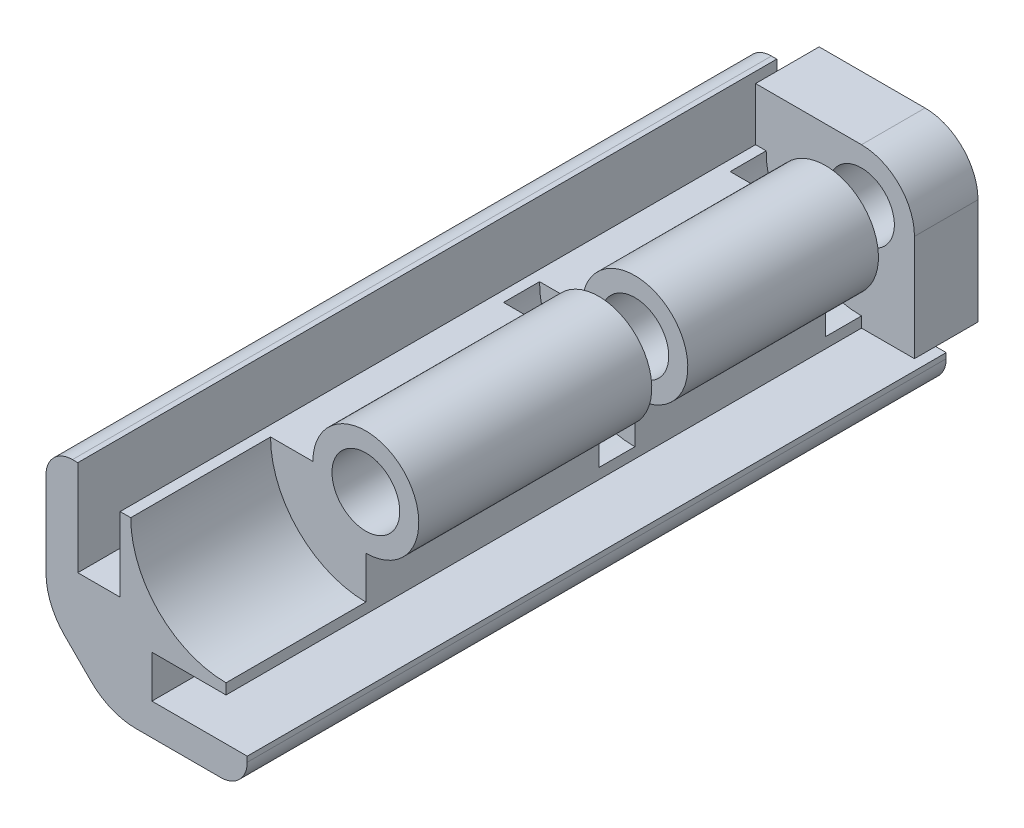
ISO-10303-21;
HEADER;
FILE_DESCRIPTION(('STEP AP214'),'2;1');
FILE_NAME('part.step','',(''),(''),'','','');
FILE_SCHEMA(('AUTOMOTIVE_DESIGN { 1 0 10303 214 1 1 1 1 }'));
ENDSEC;
DATA;
#1=APPLICATION_CONTEXT('core data for automotive mechanical design processes');
#2=APPLICATION_PROTOCOL_DEFINITION('international standard','automotive_design',2000,#1);
#3=PRODUCT_CONTEXT('',#1,'mechanical');
#4=PRODUCT('Part','Part','',(#3));
#5=PRODUCT_RELATED_PRODUCT_CATEGORY('part','',(#4));
#6=PRODUCT_DEFINITION_FORMATION('','',#4);
#7=PRODUCT_DEFINITION_CONTEXT('part definition',#1,'design');
#8=PRODUCT_DEFINITION('design','',#6,#7);
#9=PRODUCT_DEFINITION_SHAPE('','',#8);
#10=(LENGTH_UNIT() NAMED_UNIT(*) SI_UNIT(.MILLI.,.METRE.));
#11=(NAMED_UNIT(*) PLANE_ANGLE_UNIT() SI_UNIT($,.RADIAN.));
#12=(NAMED_UNIT(*) SI_UNIT($,.STERADIAN.) SOLID_ANGLE_UNIT());
#13=UNCERTAINTY_MEASURE_WITH_UNIT(LENGTH_MEASURE(1.E-05),#10,'distance_accuracy_value','');
#14=(GEOMETRIC_REPRESENTATION_CONTEXT(3) GLOBAL_UNCERTAINTY_ASSIGNED_CONTEXT((#13)) GLOBAL_UNIT_ASSIGNED_CONTEXT((#10,
#11,#12)) REPRESENTATION_CONTEXT('',''));
#15=CARTESIAN_POINT('',(0.,0.,0.));
#16=DIRECTION('',(0.,0.,1.));
#17=DIRECTION('',(1.,0.,0.));
#18=AXIS2_PLACEMENT_3D('',#15,#16,#17);
#19=CARTESIAN_POINT('',(8.5,8.5,3.));
#20=DIRECTION('',(0.,0.,1.));
#21=DIRECTION('',(1.,0.,0.));
#22=AXIS2_PLACEMENT_3D('',#19,#20,#21);
#23=CYLINDRICAL_SURFACE('',#22,4.5);
#24=CARTESIAN_POINT('',(8.5,8.5,4.7));
#25=DIRECTION('',(0.,0.,1.));
#26=DIRECTION('',(1.,0.,0.));
#27=AXIS2_PLACEMENT_3D('',#24,#25,#26);
#28=CIRCLE('',#27,4.5);
#29=CARTESIAN_POINT('',(8.5,4.,4.7));
#30=VERTEX_POINT('',#29);
#31=CARTESIAN_POINT('',(4.,8.5,4.7));
#32=VERTEX_POINT('',#31);
#33=EDGE_CURVE('E249',#30,#32,#28,.F.);
#34=ORIENTED_EDGE('',*,*,#33,.F.);
#35=DIRECTION('',(0.,0.,1.));
#36=VECTOR('',#35,1.);
#37=CARTESIAN_POINT('',(8.5,4.,3.));
#38=LINE('',#37,#36);
#39=CARTESIAN_POINT('',(8.5,4.,3.));
#40=VERTEX_POINT('',#39);
#41=EDGE_CURVE('E341',#40,#30,#38,.T.);
#42=ORIENTED_EDGE('',*,*,#41,.F.);
#43=CARTESIAN_POINT('',(8.5,8.5,3.));
#44=DIRECTION('',(0.,0.,1.));
#45=DIRECTION('',(-1.,0.,0.));
#46=AXIS2_PLACEMENT_3D('',#43,#44,#45);
#47=CIRCLE('',#46,4.5);
#48=CARTESIAN_POINT('',(4.,8.5,3.));
#49=VERTEX_POINT('',#48);
#50=EDGE_CURVE('E306',#49,#40,#47,.T.);
#51=ORIENTED_EDGE('',*,*,#50,.F.);
#52=DIRECTION('',(0.,0.,1.));
#53=VECTOR('',#52,1.);
#54=CARTESIAN_POINT('',(4.,8.5,3.));
#55=LINE('',#54,#53);
#56=EDGE_CURVE('E332',#49,#32,#55,.T.);
#57=ORIENTED_EDGE('',*,*,#56,.T.);
#58=EDGE_LOOP('',(#34,#42,#51,#57));
#59=FACE_BOUND('',#58,.T.);
#60=ADVANCED_FACE('F37',(#59),#23,.F.);
#61=CARTESIAN_POINT('',(8.5,4.,13.7));
#62=VERTEX_POINT('',#61);
#63=CARTESIAN_POINT('',(8.50000000002638,4.,15.4));
#64=VERTEX_POINT('',#63);
#65=EDGE_CURVE('E344',#62,#64,#38,.T.);
#66=ORIENTED_EDGE('',*,*,#65,.F.);
#67=CARTESIAN_POINT('',(8.5,8.5,13.7));
#68=DIRECTION('',(0.,0.,1.));
#69=DIRECTION('',(1.,0.,0.));
#70=AXIS2_PLACEMENT_3D('',#67,#68,#69);
#71=CIRCLE('',#70,4.5);
#72=CARTESIAN_POINT('',(4.,8.5,13.7));
#73=VERTEX_POINT('',#72);
#74=EDGE_CURVE('E273',#62,#73,#71,.F.);
#75=ORIENTED_EDGE('',*,*,#74,.T.);
#76=CARTESIAN_POINT('',(4.0000000000191,8.50000000002638,15.4));
#77=VERTEX_POINT('',#76);
#78=EDGE_CURVE('E255',#73,#77,#55,.T.);
#79=ORIENTED_EDGE('',*,*,#78,.T.);
#80=CARTESIAN_POINT('',(8.5,8.5,15.4));
#81=DIRECTION('',(0.,0.,1.));
#82=DIRECTION('',(1.,0.,0.));
#83=AXIS2_PLACEMENT_3D('',#80,#81,#82);
#84=CIRCLE('',#83,4.5);
#85=EDGE_CURVE('E294',#77,#64,#84,.T.);
#86=ORIENTED_EDGE('',*,*,#85,.T.);
#87=EDGE_LOOP('',(#66,#75,#79,#86));
#88=FACE_BOUND('',#87,.T.);
#89=ADVANCED_FACE('F594',(#88),#23,.F.);
#90=CARTESIAN_POINT('',(4.24264068711928,3.,33.));
#91=DIRECTION('',(0.,0.,1.));
#92=DIRECTION('',(1.,0.,0.));
#93=AXIS2_PLACEMENT_3D('',#90,#91,#92);
#94=PLANE('',#93);
#95=DIRECTION('',(1.,0.,0.));
#96=VECTOR('',#95,1.);
#97=CARTESIAN_POINT('',(4.,8.5,33.));
#98=LINE('',#97,#96);
#99=CARTESIAN_POINT('',(3.50000000000006,8.5,33.));
#100=VERTEX_POINT('',#99);
#101=CARTESIAN_POINT('',(4.,8.5,33.));
#102=VERTEX_POINT('',#101);
#103=EDGE_CURVE('E310',#100,#102,#98,.T.);
#104=ORIENTED_EDGE('',*,*,#103,.F.);
#105=DIRECTION('',(0.,-1.,0.));
#106=VECTOR('',#105,1.);
#107=CARTESIAN_POINT('',(3.50000000000006,5.,33.));
#108=LINE('',#107,#106);
#109=CARTESIAN_POINT('',(3.50000000000006,5.,33.));
#110=VERTEX_POINT('',#109);
#111=EDGE_CURVE('E366',#100,#110,#108,.T.);
#112=ORIENTED_EDGE('',*,*,#111,.T.);
#113=DIRECTION('',(-1.,0.,0.));
#114=VECTOR('',#113,1.);
#115=CARTESIAN_POINT('',(3.50000000000006,5.,33.));
#116=LINE('',#115,#114);
#117=CARTESIAN_POINT('',(1.50000000000006,5.,33.));
#118=VERTEX_POINT('',#117);
#119=EDGE_CURVE('E368',#110,#118,#116,.T.);
#120=ORIENTED_EDGE('',*,*,#119,.T.);
#121=DIRECTION('',(0.,1.,0.));
#122=VECTOR('',#121,1.);
#123=CARTESIAN_POINT('',(1.50000000000006,5.,33.));
#124=LINE('',#123,#122);
#125=CARTESIAN_POINT('',(1.50000000000006,9.5,33.));
#126=VERTEX_POINT('',#125);
#127=EDGE_CURVE('E370',#118,#126,#124,.T.);
#128=ORIENTED_EDGE('',*,*,#127,.T.);
#129=DIRECTION('',(-1.,0.,0.));
#130=VECTOR('',#129,1.);
#131=CARTESIAN_POINT('',(1.50000000000006,9.5,33.));
#132=LINE('',#131,#130);
#133=CARTESIAN_POINT('',(1.25000000000001,9.5,33.));
#134=VERTEX_POINT('',#133);
#135=EDGE_CURVE('E372',#126,#134,#132,.T.);
#136=ORIENTED_EDGE('',*,*,#135,.T.);
#137=CARTESIAN_POINT('',(1.25,8.25,33.));
#138=DIRECTION('',(0.,0.,1.));
#139=DIRECTION('',(1.,0.,0.));
#140=AXIS2_PLACEMENT_3D('',#137,#138,#139);
#141=CIRCLE('',#140,1.25);
#142=CARTESIAN_POINT('',(0.,8.24999999999999,33.));
#143=VERTEX_POINT('',#142);
#144=EDGE_CURVE('E374',#134,#143,#141,.T.);
#145=ORIENTED_EDGE('',*,*,#144,.T.);
#146=DIRECTION('',(0.,-1.,0.));
#147=VECTOR('',#146,1.);
#148=CARTESIAN_POINT('',(0.,8.24999999999999,33.));
#149=LINE('',#148,#147);
#150=CARTESIAN_POINT('',(0.,4.24264068711929,33.));
#151=VERTEX_POINT('',#150);
#152=EDGE_CURVE('E376',#143,#151,#149,.T.);
#153=ORIENTED_EDGE('',*,*,#152,.T.);
#154=CARTESIAN_POINT('',(3.,4.24264068711929,33.));
#155=DIRECTION('',(0.,0.,1.));
#156=DIRECTION('',(1.,0.,0.));
#157=AXIS2_PLACEMENT_3D('',#154,#155,#156);
#158=CIRCLE('',#157,3.);
#159=CARTESIAN_POINT('',(0.878679656440357,2.12132034355964,33.));
#160=VERTEX_POINT('',#159);
#161=EDGE_CURVE('E378',#151,#160,#158,.T.);
#162=ORIENTED_EDGE('',*,*,#161,.T.);
#163=DIRECTION('',(0.707106781186548,-0.707106781186547,0.));
#164=VECTOR('',#163,1.);
#165=CARTESIAN_POINT('',(2.12132034355964,0.878679656440358,33.));
#166=LINE('',#165,#164);
#167=CARTESIAN_POINT('',(2.12132034355964,0.878679656440358,33.));
#168=VERTEX_POINT('',#167);
#169=EDGE_CURVE('E380',#160,#168,#166,.T.);
#170=ORIENTED_EDGE('',*,*,#169,.T.);
#171=CARTESIAN_POINT('',(4.24264068711928,3.,33.));
#172=DIRECTION('',(0.,0.,1.));
#173=DIRECTION('',(1.,0.,0.));
#174=AXIS2_PLACEMENT_3D('',#171,#172,#173);
#175=CIRCLE('',#174,3.);
#176=CARTESIAN_POINT('',(4.24264068711928,0.,33.));
#177=VERTEX_POINT('',#176);
#178=EDGE_CURVE('E349',#168,#177,#175,.T.);
#179=ORIENTED_EDGE('',*,*,#178,.T.);
#180=DIRECTION('',(1.,0.,0.));
#181=VECTOR('',#180,1.);
#182=CARTESIAN_POINT('',(8.25,0.,33.));
#183=LINE('',#182,#181);
#184=CARTESIAN_POINT('',(8.25,0.,33.));
#185=VERTEX_POINT('',#184);
#186=EDGE_CURVE('E352',#177,#185,#183,.T.);
#187=ORIENTED_EDGE('',*,*,#186,.T.);
#188=CARTESIAN_POINT('',(8.25,1.25,33.));
#189=DIRECTION('',(0.,0.,1.));
#190=DIRECTION('',(-1.,0.,0.));
#191=AXIS2_PLACEMENT_3D('',#188,#189,#190);
#192=CIRCLE('',#191,1.25);
#193=CARTESIAN_POINT('',(9.5,1.25,33.));
#194=VERTEX_POINT('',#193);
#195=EDGE_CURVE('E355',#185,#194,#192,.T.);
#196=ORIENTED_EDGE('',*,*,#195,.T.);
#197=DIRECTION('',(0.,1.,0.));
#198=VECTOR('',#197,1.);
#199=CARTESIAN_POINT('',(9.5,1.5,33.));
#200=LINE('',#199,#198);
#201=CARTESIAN_POINT('',(9.5,1.5,33.));
#202=VERTEX_POINT('',#201);
#203=EDGE_CURVE('E357',#194,#202,#200,.T.);
#204=ORIENTED_EDGE('',*,*,#203,.T.);
#205=DIRECTION('',(-1.,0.,0.));
#206=VECTOR('',#205,1.);
#207=CARTESIAN_POINT('',(5.,1.5,33.));
#208=LINE('',#207,#206);
#209=CARTESIAN_POINT('',(5.,1.5,33.));
#210=VERTEX_POINT('',#209);
#211=EDGE_CURVE('E359',#202,#210,#208,.T.);
#212=ORIENTED_EDGE('',*,*,#211,.T.);
#213=DIRECTION('',(0.,1.,0.));
#214=VECTOR('',#213,1.);
#215=CARTESIAN_POINT('',(5.,3.5,33.));
#216=LINE('',#215,#214);
#217=CARTESIAN_POINT('',(5.,3.5,33.));
#218=VERTEX_POINT('',#217);
#219=EDGE_CURVE('E361',#210,#218,#216,.T.);
#220=ORIENTED_EDGE('',*,*,#219,.T.);
#221=DIRECTION('',(1.,0.,0.));
#222=VECTOR('',#221,1.);
#223=CARTESIAN_POINT('',(5.,3.5,33.));
#224=LINE('',#223,#222);
#225=CARTESIAN_POINT('',(8.5,3.5,33.));
#226=VERTEX_POINT('',#225);
#227=EDGE_CURVE('E363',#218,#226,#224,.T.);
#228=ORIENTED_EDGE('',*,*,#227,.T.);
#229=DIRECTION('',(0.,-1.,0.));
#230=VECTOR('',#229,1.);
#231=CARTESIAN_POINT('',(8.5,4.,33.));
#232=LINE('',#231,#230);
#233=CARTESIAN_POINT('',(8.5,4.,33.));
#234=VERTEX_POINT('',#233);
#235=EDGE_CURVE('E329',#234,#226,#232,.T.);
#236=ORIENTED_EDGE('',*,*,#235,.F.);
#237=CARTESIAN_POINT('',(8.5,8.5,33.));
#238=DIRECTION('',(0.,0.,1.));
#239=DIRECTION('',(-1.,0.,0.));
#240=AXIS2_PLACEMENT_3D('',#237,#238,#239);
#241=CIRCLE('',#240,4.5);
#242=EDGE_CURVE('E304',#102,#234,#241,.T.);
#243=ORIENTED_EDGE('',*,*,#242,.F.);
#244=EDGE_LOOP('',(#104,#112,#120,#128,#136,#145,#153,#162,#170,#179,#187,#196,#204,#212,#220,
#228,#236,#243));
#245=FACE_BOUND('',#244,.T.);
#246=ADVANCED_FACE('F491',(#245),#94,.T.);
#247=CARTESIAN_POINT('',(4.24264068711928,3.,0.));
#248=DIRECTION('',(0.,0.,1.));
#249=DIRECTION('',(1.,0.,0.));
#250=AXIS2_PLACEMENT_3D('',#247,#248,#249);
#251=PLANE('',#250);
#252=CARTESIAN_POINT('',(4.24264068711928,3.,0.));
#253=DIRECTION('',(0.,0.,1.));
#254=DIRECTION('',(1.,0.,0.));
#255=AXIS2_PLACEMENT_3D('',#252,#253,#254);
#256=CIRCLE('',#255,3.);
#257=CARTESIAN_POINT('',(2.12132034355964,0.878679656440358,0.));
#258=VERTEX_POINT('',#257);
#259=CARTESIAN_POINT('',(4.24264068711928,0.,0.));
#260=VERTEX_POINT('',#259);
#261=EDGE_CURVE('E348',#258,#260,#256,.T.);
#262=ORIENTED_EDGE('',*,*,#261,.F.);
#263=DIRECTION('',(0.707106781186548,-0.707106781186547,0.));
#264=VECTOR('',#263,1.);
#265=CARTESIAN_POINT('',(2.12132034355964,0.878679656440358,0.));
#266=LINE('',#265,#264);
#267=CARTESIAN_POINT('',(0.878679656440357,2.12132034355964,0.));
#268=VERTEX_POINT('',#267);
#269=EDGE_CURVE('E353',#268,#258,#266,.T.);
#270=ORIENTED_EDGE('',*,*,#269,.F.);
#271=CARTESIAN_POINT('',(3.,4.24264068711929,0.));
#272=DIRECTION('',(0.,0.,1.));
#273=DIRECTION('',(1.,0.,0.));
#274=AXIS2_PLACEMENT_3D('',#271,#272,#273);
#275=CIRCLE('',#274,3.);
#276=CARTESIAN_POINT('',(0.,4.24264068711929,0.));
#277=VERTEX_POINT('',#276);
#278=EDGE_CURVE('E419',#277,#268,#275,.T.);
#279=ORIENTED_EDGE('',*,*,#278,.F.);
#280=DIRECTION('',(0.,-1.,0.));
#281=VECTOR('',#280,1.);
#282=CARTESIAN_POINT('',(0.,8.24999999999999,0.));
#283=LINE('',#282,#281);
#284=CARTESIAN_POINT('',(0.,8.24999999999999,0.));
#285=VERTEX_POINT('',#284);
#286=EDGE_CURVE('E417',#285,#277,#283,.T.);
#287=ORIENTED_EDGE('',*,*,#286,.F.);
#288=CARTESIAN_POINT('',(1.25,8.25,0.));
#289=DIRECTION('',(0.,0.,1.));
#290=DIRECTION('',(1.,0.,0.));
#291=AXIS2_PLACEMENT_3D('',#288,#289,#290);
#292=CIRCLE('',#291,1.25);
#293=CARTESIAN_POINT('',(1.25000000000001,9.5,0.));
#294=VERTEX_POINT('',#293);
#295=EDGE_CURVE('E415',#294,#285,#292,.T.);
#296=ORIENTED_EDGE('',*,*,#295,.F.);
#297=DIRECTION('',(-1.,0.,0.));
#298=VECTOR('',#297,1.);
#299=CARTESIAN_POINT('',(1.50000000000006,9.5,0.));
#300=LINE('',#299,#298);
#301=CARTESIAN_POINT('',(1.50000000000006,9.5,0.));
#302=VERTEX_POINT('',#301);
#303=EDGE_CURVE('E413',#302,#294,#300,.T.);
#304=ORIENTED_EDGE('',*,*,#303,.F.);
#305=DIRECTION('',(0.,1.,0.));
#306=VECTOR('',#305,1.);
#307=CARTESIAN_POINT('',(1.50000000000006,5.,0.));
#308=LINE('',#307,#306);
#309=CARTESIAN_POINT('',(1.50000000000006,5.,0.));
#310=VERTEX_POINT('',#309);
#311=EDGE_CURVE('E411',#310,#302,#308,.T.);
#312=ORIENTED_EDGE('',*,*,#311,.F.);
#313=DIRECTION('',(-1.,0.,0.));
#314=VECTOR('',#313,1.);
#315=CARTESIAN_POINT('',(3.50000000000006,5.,0.));
#316=LINE('',#315,#314);
#317=CARTESIAN_POINT('',(3.50000000000006,5.,0.));
#318=VERTEX_POINT('',#317);
#319=EDGE_CURVE('E409',#318,#310,#316,.T.);
#320=ORIENTED_EDGE('',*,*,#319,.F.);
#321=DIRECTION('',(0.,-1.,0.));
#322=VECTOR('',#321,1.);
#323=CARTESIAN_POINT('',(3.50000000000006,5.,0.));
#324=LINE('',#323,#322);
#325=CARTESIAN_POINT('',(3.50000000000006,11.,0.));
#326=VERTEX_POINT('',#325);
#327=EDGE_CURVE('E407',#326,#318,#324,.T.);
#328=ORIENTED_EDGE('',*,*,#327,.F.);
#329=DIRECTION('',(-1.,0.,0.));
#330=VECTOR('',#329,1.);
#331=CARTESIAN_POINT('',(8.50000000000006,11.,0.));
#332=LINE('',#331,#330);
#333=CARTESIAN_POINT('',(8.50000000000006,11.,0.));
#334=VERTEX_POINT('',#333);
#335=EDGE_CURVE('E404',#334,#326,#332,.T.);
#336=ORIENTED_EDGE('',*,*,#335,.F.);
#337=CARTESIAN_POINT('',(8.5,8.5,0.));
#338=DIRECTION('',(0.,0.,1.));
#339=DIRECTION('',(-1.,0.,0.));
#340=AXIS2_PLACEMENT_3D('',#337,#338,#339);
#341=CIRCLE('',#340,2.5);
#342=CARTESIAN_POINT('',(11.,8.5,0.));
#343=VERTEX_POINT('',#342);
#344=EDGE_CURVE('E401',#343,#334,#341,.T.);
#345=ORIENTED_EDGE('',*,*,#344,.F.);
#346=DIRECTION('',(0.,1.,0.));
#347=VECTOR('',#346,1.);
#348=CARTESIAN_POINT('',(11.,3.5,0.));
#349=LINE('',#348,#347);
#350=CARTESIAN_POINT('',(11.,3.5,0.));
#351=VERTEX_POINT('',#350);
#352=EDGE_CURVE('E398',#351,#343,#349,.T.);
#353=ORIENTED_EDGE('',*,*,#352,.F.);
#354=DIRECTION('',(1.,0.,0.));
#355=VECTOR('',#354,1.);
#356=CARTESIAN_POINT('',(5.,3.5,0.));
#357=LINE('',#356,#355);
#358=CARTESIAN_POINT('',(5.,3.5,0.));
#359=VERTEX_POINT('',#358);
#360=EDGE_CURVE('E395',#359,#351,#357,.T.);
#361=ORIENTED_EDGE('',*,*,#360,.F.);
#362=DIRECTION('',(0.,1.,0.));
#363=VECTOR('',#362,1.);
#364=CARTESIAN_POINT('',(5.,3.5,0.));
#365=LINE('',#364,#363);
#366=CARTESIAN_POINT('',(5.,1.5,0.));
#367=VERTEX_POINT('',#366);
#368=EDGE_CURVE('E393',#367,#359,#365,.T.);
#369=ORIENTED_EDGE('',*,*,#368,.F.);
#370=DIRECTION('',(-1.,0.,0.));
#371=VECTOR('',#370,1.);
#372=CARTESIAN_POINT('',(5.,1.5,0.));
#373=LINE('',#372,#371);
#374=CARTESIAN_POINT('',(9.5,1.5,0.));
#375=VERTEX_POINT('',#374);
#376=EDGE_CURVE('E391',#375,#367,#373,.T.);
#377=ORIENTED_EDGE('',*,*,#376,.F.);
#378=DIRECTION('',(0.,1.,0.));
#379=VECTOR('',#378,1.);
#380=CARTESIAN_POINT('',(9.5,1.5,0.));
#381=LINE('',#380,#379);
#382=CARTESIAN_POINT('',(9.5,1.25,0.));
#383=VERTEX_POINT('',#382);
#384=EDGE_CURVE('E389',#383,#375,#381,.T.);
#385=ORIENTED_EDGE('',*,*,#384,.F.);
#386=CARTESIAN_POINT('',(8.25,1.25,0.));
#387=DIRECTION('',(0.,0.,1.));
#388=DIRECTION('',(-1.,0.,0.));
#389=AXIS2_PLACEMENT_3D('',#386,#387,#388);
#390=CIRCLE('',#389,1.25);
#391=CARTESIAN_POINT('',(8.25,0.,0.));
#392=VERTEX_POINT('',#391);
#393=EDGE_CURVE('E387',#392,#383,#390,.T.);
#394=ORIENTED_EDGE('',*,*,#393,.F.);
#395=DIRECTION('',(1.,0.,0.));
#396=VECTOR('',#395,1.);
#397=CARTESIAN_POINT('',(8.25,0.,0.));
#398=LINE('',#397,#396);
#399=EDGE_CURVE('E385',#260,#392,#398,.T.);
#400=ORIENTED_EDGE('',*,*,#399,.F.);
#401=EDGE_LOOP('',(#262,#270,#279,#287,#296,#304,#312,#320,#328,#336,#345,#353,#361,#369,#377,
#385,#394,#400));
#402=FACE_BOUND('',#401,.T.);
#403=CARTESIAN_POINT('',(8.5,8.5,0.));
#404=DIRECTION('',(0.,0.,1.));
#405=DIRECTION('',(1.,0.,0.));
#406=AXIS2_PLACEMENT_3D('',#403,#404,#405);
#407=CIRCLE('',#406,1.55);
#408=CARTESIAN_POINT('',(10.05,8.5,0.));
#409=VERTEX_POINT('',#408);
#410=EDGE_CURVE('E345',#409,#409,#407,.T.);
#411=ORIENTED_EDGE('',*,*,#410,.T.);
#412=EDGE_LOOP('',(#411));
#413=FACE_BOUND('',#412,.T.);
#414=ADVANCED_FACE('F476',(#402,#413),#251,.F.);
#415=CARTESIAN_POINT('',(4.24264068711928,3.,33.));
#416=DIRECTION('',(0.,0.,-1.));
#417=DIRECTION('',(-1.,0.,0.));
#418=AXIS2_PLACEMENT_3D('',#415,#416,#417);
#419=CYLINDRICAL_SURFACE('',#418,3.);
#420=ORIENTED_EDGE('',*,*,#261,.T.);
#421=DIRECTION('',(0.,0.,-1.));
#422=VECTOR('',#421,1.);
#423=CARTESIAN_POINT('',(4.24264068711928,0.,33.));
#424=LINE('',#423,#422);
#425=EDGE_CURVE('E11',#177,#260,#424,.T.);
#426=ORIENTED_EDGE('',*,*,#425,.F.);
#427=ORIENTED_EDGE('',*,*,#178,.F.);
#428=DIRECTION('',(0.,0.,-1.));
#429=VECTOR('',#428,1.);
#430=CARTESIAN_POINT('',(2.12132034355964,0.878679656440358,33.));
#431=LINE('',#430,#429);
#432=EDGE_CURVE('E382',#168,#258,#431,.T.);
#433=ORIENTED_EDGE('',*,*,#432,.T.);
#434=EDGE_LOOP('',(#420,#426,#427,#433));
#435=FACE_BOUND('',#434,.T.);
#436=ADVANCED_FACE('F39',(#435),#419,.T.);
#437=CARTESIAN_POINT('',(8.25,0.,33.));
#438=DIRECTION('',(0.,1.,0.));
#439=DIRECTION('',(-1.,0.,0.));
#440=AXIS2_PLACEMENT_3D('',#437,#438,#439);
#441=PLANE('',#440);
#442=ORIENTED_EDGE('',*,*,#399,.T.);
#443=DIRECTION('',(0.,0.,-1.));
#444=VECTOR('',#443,1.);
#445=CARTESIAN_POINT('',(8.25,0.,33.));
#446=LINE('',#445,#444);
#447=EDGE_CURVE('E46',#185,#392,#446,.T.);
#448=ORIENTED_EDGE('',*,*,#447,.F.);
#449=ORIENTED_EDGE('',*,*,#186,.F.);
#450=ORIENTED_EDGE('',*,*,#425,.T.);
#451=EDGE_LOOP('',(#442,#448,#449,#450));
#452=FACE_BOUND('',#451,.T.);
#453=ADVANCED_FACE('F495',(#452),#441,.F.);
#454=CARTESIAN_POINT('',(8.25,1.25,33.));
#455=DIRECTION('',(0.,0.,-1.));
#456=DIRECTION('',(-1.,0.,0.));
#457=AXIS2_PLACEMENT_3D('',#454,#455,#456);
#458=CYLINDRICAL_SURFACE('',#457,1.25);
#459=ORIENTED_EDGE('',*,*,#393,.T.);
#460=DIRECTION('',(0.,0.,-1.));
#461=VECTOR('',#460,1.);
#462=CARTESIAN_POINT('',(9.5,1.25,33.));
#463=LINE('',#462,#461);
#464=EDGE_CURVE('E462',#194,#383,#463,.T.);
#465=ORIENTED_EDGE('',*,*,#464,.F.);
#466=ORIENTED_EDGE('',*,*,#195,.F.);
#467=ORIENTED_EDGE('',*,*,#447,.T.);
#468=EDGE_LOOP('',(#459,#465,#466,#467));
#469=FACE_BOUND('',#468,.T.);
#470=ADVANCED_FACE('F470',(#469),#458,.T.);
#471=CARTESIAN_POINT('',(9.5,1.5,33.));
#472=DIRECTION('',(-1.,0.,0.));
#473=DIRECTION('',(0.,0.,1.));
#474=AXIS2_PLACEMENT_3D('',#471,#472,#473);
#475=PLANE('',#474);
#476=ORIENTED_EDGE('',*,*,#384,.T.);
#477=DIRECTION('',(0.,0.,-1.));
#478=VECTOR('',#477,1.);
#479=CARTESIAN_POINT('',(9.5,1.5,33.));
#480=LINE('',#479,#478);
#481=EDGE_CURVE('E459',#202,#375,#480,.T.);
#482=ORIENTED_EDGE('',*,*,#481,.F.);
#483=ORIENTED_EDGE('',*,*,#203,.F.);
#484=ORIENTED_EDGE('',*,*,#464,.T.);
#485=EDGE_LOOP('',(#476,#482,#483,#484));
#486=FACE_BOUND('',#485,.T.);
#487=ADVANCED_FACE('F482',(#486),#475,.F.);
#488=CARTESIAN_POINT('',(5.,1.5,33.));
#489=DIRECTION('',(0.,-1.,0.));
#490=DIRECTION('',(0.,0.,-1.));
#491=AXIS2_PLACEMENT_3D('',#488,#489,#490);
#492=PLANE('',#491);
#493=ORIENTED_EDGE('',*,*,#376,.T.);
#494=DIRECTION('',(0.,0.,-1.));
#495=VECTOR('',#494,1.);
#496=CARTESIAN_POINT('',(5.,1.5,33.));
#497=LINE('',#496,#495);
#498=EDGE_CURVE('E456',#210,#367,#497,.T.);
#499=ORIENTED_EDGE('',*,*,#498,.F.);
#500=ORIENTED_EDGE('',*,*,#211,.F.);
#501=ORIENTED_EDGE('',*,*,#481,.T.);
#502=EDGE_LOOP('',(#493,#499,#500,#501));
#503=FACE_BOUND('',#502,.T.);
#504=ADVANCED_FACE('F486',(#503),#492,.F.);
#505=CARTESIAN_POINT('',(5.,3.5,33.));
#506=DIRECTION('',(-1.,0.,0.));
#507=DIRECTION('',(0.,0.,1.));
#508=AXIS2_PLACEMENT_3D('',#505,#506,#507);
#509=PLANE('',#508);
#510=ORIENTED_EDGE('',*,*,#368,.T.);
#511=DIRECTION('',(0.,0.,-1.));
#512=VECTOR('',#511,1.);
#513=CARTESIAN_POINT('',(5.,3.5,33.));
#514=LINE('',#513,#512);
#515=EDGE_CURVE('E453',#218,#359,#514,.T.);
#516=ORIENTED_EDGE('',*,*,#515,.F.);
#517=ORIENTED_EDGE('',*,*,#219,.F.);
#518=ORIENTED_EDGE('',*,*,#498,.T.);
#519=EDGE_LOOP('',(#510,#516,#517,#518));
#520=FACE_BOUND('',#519,.T.);
#521=ADVANCED_FACE('F561',(#520),#509,.F.);
#522=CARTESIAN_POINT('',(5.,3.5,33.));
#523=DIRECTION('',(0.,1.,0.));
#524=DIRECTION('',(0.,0.,1.));
#525=AXIS2_PLACEMENT_3D('',#522,#523,#524);
#526=PLANE('',#525);
#527=DIRECTION('',(1.,0.,0.));
#528=VECTOR('',#527,1.);
#529=CARTESIAN_POINT('',(8.5,3.5,3.));
#530=LINE('',#529,#528);
#531=CARTESIAN_POINT('',(8.5,3.5,3.));
#532=VERTEX_POINT('',#531);
#533=CARTESIAN_POINT('',(11.,3.5,3.));
#534=VERTEX_POINT('',#533);
#535=EDGE_CURVE('E313',#532,#534,#530,.T.);
#536=ORIENTED_EDGE('',*,*,#535,.F.);
#537=DIRECTION('',(0.,0.,1.));
#538=VECTOR('',#537,1.);
#539=CARTESIAN_POINT('',(8.5,3.5,3.));
#540=LINE('',#539,#538);
#541=EDGE_CURVE('E338',#532,#226,#540,.T.);
#542=ORIENTED_EDGE('',*,*,#541,.T.);
#543=ORIENTED_EDGE('',*,*,#227,.F.);
#544=ORIENTED_EDGE('',*,*,#515,.T.);
#545=ORIENTED_EDGE('',*,*,#360,.T.);
#546=DIRECTION('',(0.,0.,-1.));
#547=VECTOR('',#546,1.);
#548=CARTESIAN_POINT('',(11.,3.5,33.));
#549=LINE('',#548,#547);
#550=EDGE_CURVE('E451',#534,#351,#549,.T.);
#551=ORIENTED_EDGE('',*,*,#550,.F.);
#552=EDGE_LOOP('',(#536,#542,#543,#544,#545,#551));
#553=FACE_BOUND('',#552,.T.);
#554=ADVANCED_FACE('F558',(#553),#526,.F.);
#555=CARTESIAN_POINT('',(11.,3.5,33.));
#556=DIRECTION('',(-1.,0.,0.));
#557=DIRECTION('',(0.,-1.,0.));
#558=AXIS2_PLACEMENT_3D('',#555,#556,#557);
#559=PLANE('',#558);
#560=DIRECTION('',(0.,0.,-1.));
#561=VECTOR('',#560,1.);
#562=CARTESIAN_POINT('',(11.,8.5,33.));
#563=LINE('',#562,#561);
#564=CARTESIAN_POINT('',(11.,8.5,3.));
#565=VERTEX_POINT('',#564);
#566=EDGE_CURVE('E449',#565,#343,#563,.T.);
#567=ORIENTED_EDGE('',*,*,#566,.F.);
#568=DIRECTION('',(0.,1.,0.));
#569=VECTOR('',#568,1.);
#570=CARTESIAN_POINT('',(11.,3.5,3.));
#571=LINE('',#570,#569);
#572=EDGE_CURVE('E315',#534,#565,#571,.T.);
#573=ORIENTED_EDGE('',*,*,#572,.F.);
#574=ORIENTED_EDGE('',*,*,#550,.T.);
#575=ORIENTED_EDGE('',*,*,#352,.T.);
#576=EDGE_LOOP('',(#567,#573,#574,#575));
#577=FACE_BOUND('',#576,.T.);
#578=ADVANCED_FACE('F554',(#577),#559,.F.);
#579=CARTESIAN_POINT('',(8.5,8.5,33.));
#580=DIRECTION('',(0.,0.,-1.));
#581=DIRECTION('',(-1.,0.,0.));
#582=AXIS2_PLACEMENT_3D('',#579,#580,#581);
#583=CYLINDRICAL_SURFACE('',#582,2.5);
#584=DIRECTION('',(0.,0.,-1.));
#585=VECTOR('',#584,1.);
#586=CARTESIAN_POINT('',(8.50000000000006,11.,33.));
#587=LINE('',#586,#585);
#588=CARTESIAN_POINT('',(8.50000000000006,11.,3.));
#589=VERTEX_POINT('',#588);
#590=EDGE_CURVE('E447',#589,#334,#587,.T.);
#591=ORIENTED_EDGE('',*,*,#590,.F.);
#592=CARTESIAN_POINT('',(8.5,8.5,3.));
#593=DIRECTION('',(0.,0.,1.));
#594=DIRECTION('',(-1.,0.,0.));
#595=AXIS2_PLACEMENT_3D('',#592,#593,#594);
#596=CIRCLE('',#595,2.5);
#597=EDGE_CURVE('E317',#565,#589,#596,.T.);
#598=ORIENTED_EDGE('',*,*,#597,.F.);
#599=ORIENTED_EDGE('',*,*,#566,.T.);
#600=ORIENTED_EDGE('',*,*,#344,.T.);
#601=EDGE_LOOP('',(#591,#598,#599,#600));
#602=FACE_BOUND('',#601,.T.);
#603=ADVANCED_FACE('F549',(#602),#583,.T.);
#604=CARTESIAN_POINT('',(8.50000000000006,11.,33.));
#605=DIRECTION('',(0.,-1.,0.));
#606=DIRECTION('',(0.,0.,-1.));
#607=AXIS2_PLACEMENT_3D('',#604,#605,#606);
#608=PLANE('',#607);
#609=DIRECTION('',(0.,0.,-1.));
#610=VECTOR('',#609,1.);
#611=CARTESIAN_POINT('',(3.50000000000006,11.,33.));
#612=LINE('',#611,#610);
#613=CARTESIAN_POINT('',(3.50000000000006,11.,3.));
#614=VERTEX_POINT('',#613);
#615=EDGE_CURVE('E445',#614,#326,#612,.T.);
#616=ORIENTED_EDGE('',*,*,#615,.F.);
#617=DIRECTION('',(-1.,0.,0.));
#618=VECTOR('',#617,1.);
#619=CARTESIAN_POINT('',(3.50000000000006,11.,3.));
#620=LINE('',#619,#618);
#621=EDGE_CURVE('E319',#589,#614,#620,.T.);
#622=ORIENTED_EDGE('',*,*,#621,.F.);
#623=ORIENTED_EDGE('',*,*,#590,.T.);
#624=ORIENTED_EDGE('',*,*,#335,.T.);
#625=EDGE_LOOP('',(#616,#622,#623,#624));
#626=FACE_BOUND('',#625,.T.);
#627=ADVANCED_FACE('F543',(#626),#608,.F.);
#628=CARTESIAN_POINT('',(3.50000000000006,5.,33.));
#629=DIRECTION('',(1.,0.,0.));
#630=DIRECTION('',(0.,0.,-1.));
#631=AXIS2_PLACEMENT_3D('',#628,#629,#630);
#632=PLANE('',#631);
#633=ORIENTED_EDGE('',*,*,#111,.F.);
#634=DIRECTION('',(0.,0.,1.));
#635=VECTOR('',#634,1.);
#636=CARTESIAN_POINT('',(3.50000000000006,8.5,3.));
#637=LINE('',#636,#635);
#638=CARTESIAN_POINT('',(3.50000000000006,8.5,3.));
#639=VERTEX_POINT('',#638);
#640=EDGE_CURVE('E336',#639,#100,#637,.T.);
#641=ORIENTED_EDGE('',*,*,#640,.F.);
#642=DIRECTION('',(0.,-1.,0.));
#643=VECTOR('',#642,1.);
#644=CARTESIAN_POINT('',(3.50000000000006,10.,3.));
#645=LINE('',#644,#643);
#646=EDGE_CURVE('E321',#614,#639,#645,.T.);
#647=ORIENTED_EDGE('',*,*,#646,.F.);
#648=ORIENTED_EDGE('',*,*,#615,.T.);
#649=ORIENTED_EDGE('',*,*,#327,.T.);
#650=DIRECTION('',(0.,0.,-1.));
#651=VECTOR('',#650,1.);
#652=CARTESIAN_POINT('',(3.50000000000006,5.,33.));
#653=LINE('',#652,#651);
#654=EDGE_CURVE('E442',#110,#318,#653,.T.);
#655=ORIENTED_EDGE('',*,*,#654,.F.);
#656=EDGE_LOOP('',(#633,#641,#647,#648,#649,#655));
#657=FACE_BOUND('',#656,.T.);
#658=ADVANCED_FACE('F537',(#657),#632,.F.);
#659=CARTESIAN_POINT('',(3.50000000000006,5.,33.));
#660=DIRECTION('',(0.,-1.,0.));
#661=DIRECTION('',(0.,0.,-1.));
#662=AXIS2_PLACEMENT_3D('',#659,#660,#661);
#663=PLANE('',#662);
#664=ORIENTED_EDGE('',*,*,#319,.T.);
#665=DIRECTION('',(0.,0.,-1.));
#666=VECTOR('',#665,1.);
#667=CARTESIAN_POINT('',(1.50000000000006,5.,33.));
#668=LINE('',#667,#666);
#669=EDGE_CURVE('E439',#118,#310,#668,.T.);
#670=ORIENTED_EDGE('',*,*,#669,.F.);
#671=ORIENTED_EDGE('',*,*,#119,.F.);
#672=ORIENTED_EDGE('',*,*,#654,.T.);
#673=EDGE_LOOP('',(#664,#670,#671,#672));
#674=FACE_BOUND('',#673,.T.);
#675=ADVANCED_FACE('F532',(#674),#663,.F.);
#676=CARTESIAN_POINT('',(1.50000000000006,5.,33.));
#677=DIRECTION('',(-1.,0.,0.));
#678=DIRECTION('',(0.,0.,1.));
#679=AXIS2_PLACEMENT_3D('',#676,#677,#678);
#680=PLANE('',#679);
#681=ORIENTED_EDGE('',*,*,#311,.T.);
#682=DIRECTION('',(0.,0.,-1.));
#683=VECTOR('',#682,1.);
#684=CARTESIAN_POINT('',(1.50000000000006,9.5,33.));
#685=LINE('',#684,#683);
#686=EDGE_CURVE('E436',#126,#302,#685,.T.);
#687=ORIENTED_EDGE('',*,*,#686,.F.);
#688=ORIENTED_EDGE('',*,*,#127,.F.);
#689=ORIENTED_EDGE('',*,*,#669,.T.);
#690=EDGE_LOOP('',(#681,#687,#688,#689));
#691=FACE_BOUND('',#690,.T.);
#692=ADVANCED_FACE('F526',(#691),#680,.F.);
#693=CARTESIAN_POINT('',(1.50000000000006,9.5,33.));
#694=DIRECTION('',(0.,-1.,0.));
#695=DIRECTION('',(1.,0.,0.));
#696=AXIS2_PLACEMENT_3D('',#693,#694,#695);
#697=PLANE('',#696);
#698=ORIENTED_EDGE('',*,*,#303,.T.);
#699=DIRECTION('',(0.,0.,-1.));
#700=VECTOR('',#699,1.);
#701=CARTESIAN_POINT('',(1.25000000000001,9.5,33.));
#702=LINE('',#701,#700);
#703=EDGE_CURVE('E433',#134,#294,#702,.T.);
#704=ORIENTED_EDGE('',*,*,#703,.F.);
#705=ORIENTED_EDGE('',*,*,#135,.F.);
#706=ORIENTED_EDGE('',*,*,#686,.T.);
#707=EDGE_LOOP('',(#698,#704,#705,#706));
#708=FACE_BOUND('',#707,.T.);
#709=ADVANCED_FACE('F522',(#708),#697,.F.);
#710=CARTESIAN_POINT('',(1.25,8.25,33.));
#711=DIRECTION('',(0.,0.,-1.));
#712=DIRECTION('',(-1.,0.,0.));
#713=AXIS2_PLACEMENT_3D('',#710,#711,#712);
#714=CYLINDRICAL_SURFACE('',#713,1.25);
#715=ORIENTED_EDGE('',*,*,#295,.T.);
#716=DIRECTION('',(0.,0.,-1.));
#717=VECTOR('',#716,1.);
#718=CARTESIAN_POINT('',(0.,8.24999999999999,33.));
#719=LINE('',#718,#717);
#720=EDGE_CURVE('E430',#143,#285,#719,.T.);
#721=ORIENTED_EDGE('',*,*,#720,.F.);
#722=ORIENTED_EDGE('',*,*,#144,.F.);
#723=ORIENTED_EDGE('',*,*,#703,.T.);
#724=EDGE_LOOP('',(#715,#721,#722,#723));
#725=FACE_BOUND('',#724,.T.);
#726=ADVANCED_FACE('F517',(#725),#714,.T.);
#727=CARTESIAN_POINT('',(0.,8.24999999999999,33.));
#728=DIRECTION('',(1.,0.,0.));
#729=DIRECTION('',(0.,1.,0.));
#730=AXIS2_PLACEMENT_3D('',#727,#728,#729);
#731=PLANE('',#730);
#732=ORIENTED_EDGE('',*,*,#286,.T.);
#733=DIRECTION('',(0.,0.,-1.));
#734=VECTOR('',#733,1.);
#735=CARTESIAN_POINT('',(0.,4.24264068711929,33.));
#736=LINE('',#735,#734);
#737=EDGE_CURVE('E427',#151,#277,#736,.T.);
#738=ORIENTED_EDGE('',*,*,#737,.F.);
#739=ORIENTED_EDGE('',*,*,#152,.F.);
#740=ORIENTED_EDGE('',*,*,#720,.T.);
#741=EDGE_LOOP('',(#732,#738,#739,#740));
#742=FACE_BOUND('',#741,.T.);
#743=ADVANCED_FACE('F511',(#742),#731,.F.);
#744=CARTESIAN_POINT('',(3.,4.24264068711929,33.));
#745=DIRECTION('',(0.,0.,-1.));
#746=DIRECTION('',(-1.,0.,0.));
#747=AXIS2_PLACEMENT_3D('',#744,#745,#746);
#748=CYLINDRICAL_SURFACE('',#747,3.);
#749=ORIENTED_EDGE('',*,*,#278,.T.);
#750=DIRECTION('',(0.,0.,-1.));
#751=VECTOR('',#750,1.);
#752=CARTESIAN_POINT('',(0.878679656440357,2.12132034355964,33.));
#753=LINE('',#752,#751);
#754=EDGE_CURVE('E424',#160,#268,#753,.T.);
#755=ORIENTED_EDGE('',*,*,#754,.F.);
#756=ORIENTED_EDGE('',*,*,#161,.F.);
#757=ORIENTED_EDGE('',*,*,#737,.T.);
#758=EDGE_LOOP('',(#749,#755,#756,#757));
#759=FACE_BOUND('',#758,.T.);
#760=ADVANCED_FACE('F507',(#759),#748,.T.);
#761=CARTESIAN_POINT('',(2.12132034355964,0.878679656440358,33.));
#762=DIRECTION('',(0.707106781186547,0.707106781186548,0.));
#763=DIRECTION('',(-0.707106781186548,0.707106781186547,0.));
#764=AXIS2_PLACEMENT_3D('',#761,#762,#763);
#765=PLANE('',#764);
#766=ORIENTED_EDGE('',*,*,#269,.T.);
#767=ORIENTED_EDGE('',*,*,#432,.F.);
#768=ORIENTED_EDGE('',*,*,#169,.F.);
#769=ORIENTED_EDGE('',*,*,#754,.T.);
#770=EDGE_LOOP('',(#766,#767,#768,#769));
#771=FACE_BOUND('',#770,.T.);
#772=ADVANCED_FACE('F502',(#771),#765,.F.);
#773=CARTESIAN_POINT('',(8.5,8.5,33.));
#774=DIRECTION('',(0.,0.,-1.));
#775=DIRECTION('',(-1.,0.,0.));
#776=AXIS2_PLACEMENT_3D('',#773,#774,#775);
#777=CYLINDRICAL_SURFACE('',#776,1.55);
#778=CARTESIAN_POINT('',(8.5,8.5,3.));
#779=DIRECTION('',(0.,0.,-1.));
#780=DIRECTION('',(-1.,0.,0.));
#781=AXIS2_PLACEMENT_3D('',#778,#779,#780);
#782=CIRCLE('',#781,1.55);
#783=CARTESIAN_POINT('',(6.95,8.5,3.));
#784=VERTEX_POINT('',#783);
#785=EDGE_CURVE('E41',#784,#784,#782,.T.);
#786=ORIENTED_EDGE('',*,*,#785,.F.);
#787=EDGE_LOOP('',(#786));
#788=FACE_BOUND('',#787,.T.);
#789=ORIENTED_EDGE('',*,*,#410,.F.);
#790=EDGE_LOOP('',(#789));
#791=FACE_BOUND('',#790,.T.);
#792=ADVANCED_FACE('F603',(#788,#791),#777,.F.);
#793=CARTESIAN_POINT('',(8.5,4.,26.4));
#794=VERTEX_POINT('',#793);
#795=EDGE_CURVE('E326',#794,#234,#38,.T.);
#796=ORIENTED_EDGE('',*,*,#795,.F.);
#797=CARTESIAN_POINT('',(8.5,8.5,26.4));
#798=DIRECTION('',(0.,0.,1.));
#799=DIRECTION('',(1.,0.,0.));
#800=AXIS2_PLACEMENT_3D('',#797,#798,#799);
#801=CIRCLE('',#800,4.5);
#802=CARTESIAN_POINT('',(4.0000000000191,8.50000000002638,26.4));
#803=VERTEX_POINT('',#802);
#804=EDGE_CURVE('E283',#803,#794,#801,.T.);
#805=ORIENTED_EDGE('',*,*,#804,.F.);
#806=EDGE_CURVE('E335',#803,#102,#55,.T.);
#807=ORIENTED_EDGE('',*,*,#806,.T.);
#808=ORIENTED_EDGE('',*,*,#242,.T.);
#809=EDGE_LOOP('',(#796,#805,#807,#808));
#810=FACE_BOUND('',#809,.T.);
#811=ADVANCED_FACE('F569',(#810),#23,.F.);
#812=CARTESIAN_POINT('',(4.,8.5,3.));
#813=DIRECTION('',(0.,-1.,0.));
#814=DIRECTION('',(1.,0.,0.));
#815=AXIS2_PLACEMENT_3D('',#812,#813,#814);
#816=PLANE('',#815);
#817=ORIENTED_EDGE('',*,*,#103,.T.);
#818=ORIENTED_EDGE('',*,*,#806,.F.);
#819=DIRECTION('',(1.,0.,0.));
#820=VECTOR('',#819,1.);
#821=CARTESIAN_POINT('',(-399992.,8.50000000002638,26.4));
#822=LINE('',#821,#820);
#823=CARTESIAN_POINT('',(6.,8.50000000002638,26.4));
#824=VERTEX_POINT('',#823);
#825=EDGE_CURVE('E286',#803,#824,#822,.T.);
#826=ORIENTED_EDGE('',*,*,#825,.T.);
#827=DIRECTION('',(0.,0.,-1.));
#828=VECTOR('',#827,1.);
#829=CARTESIAN_POINT('',(6.,8.50000000002638,26.4));
#830=LINE('',#829,#828);
#831=CARTESIAN_POINT('',(6.,8.50000000002638,15.4));
#832=VERTEX_POINT('',#831);
#833=EDGE_CURVE('E291',#824,#832,#830,.T.);
#834=ORIENTED_EDGE('',*,*,#833,.T.);
#835=DIRECTION('',(1.,0.,0.));
#836=VECTOR('',#835,1.);
#837=CARTESIAN_POINT('',(-399992.,8.50000000002638,15.4));
#838=LINE('',#837,#836);
#839=EDGE_CURVE('E297',#77,#832,#838,.T.);
#840=ORIENTED_EDGE('',*,*,#839,.F.);
#841=ORIENTED_EDGE('',*,*,#78,.F.);
#842=DIRECTION('',(1.,0.,0.));
#843=VECTOR('',#842,1.);
#844=CARTESIAN_POINT('',(0.,8.5,13.7));
#845=LINE('',#844,#843);
#846=CARTESIAN_POINT('',(6.,8.5,13.7));
#847=VERTEX_POINT('',#846);
#848=EDGE_CURVE('E237',#73,#847,#845,.T.);
#849=ORIENTED_EDGE('',*,*,#848,.T.);
#850=DIRECTION('',(0.,0.,-1.));
#851=VECTOR('',#850,1.);
#852=CARTESIAN_POINT('',(6.,8.5,23.5994949366117));
#853=LINE('',#852,#851);
#854=CARTESIAN_POINT('',(6.,8.5,4.7));
#855=VERTEX_POINT('',#854);
#856=EDGE_CURVE('E242',#847,#855,#853,.T.);
#857=ORIENTED_EDGE('',*,*,#856,.T.);
#858=DIRECTION('',(1.,0.,0.));
#859=VECTOR('',#858,1.);
#860=CARTESIAN_POINT('',(0.,8.5,4.7));
#861=LINE('',#860,#859);
#862=EDGE_CURVE('E268',#32,#855,#861,.T.);
#863=ORIENTED_EDGE('',*,*,#862,.F.);
#864=ORIENTED_EDGE('',*,*,#56,.F.);
#865=DIRECTION('',(1.,0.,0.));
#866=VECTOR('',#865,1.);
#867=CARTESIAN_POINT('',(4.,8.5,3.));
#868=LINE('',#867,#866);
#869=EDGE_CURVE('E323',#639,#49,#868,.T.);
#870=ORIENTED_EDGE('',*,*,#869,.F.);
#871=ORIENTED_EDGE('',*,*,#640,.T.);
#872=EDGE_LOOP('',(#817,#818,#826,#834,#840,#841,#849,#857,#863,#864,#870,#871));
#873=FACE_BOUND('',#872,.T.);
#874=ADVANCED_FACE('F253',(#873),#816,.F.);
#875=CARTESIAN_POINT('',(8.5,4.,3.));
#876=DIRECTION('',(-1.,0.,0.));
#877=DIRECTION('',(0.,0.,1.));
#878=AXIS2_PLACEMENT_3D('',#875,#876,#877);
#879=PLANE('',#878);
#880=ORIENTED_EDGE('',*,*,#235,.T.);
#881=ORIENTED_EDGE('',*,*,#541,.F.);
#882=DIRECTION('',(0.,-1.,0.));
#883=VECTOR('',#882,1.);
#884=CARTESIAN_POINT('',(8.5,4.,3.));
#885=LINE('',#884,#883);
#886=EDGE_CURVE('E309',#40,#532,#885,.T.);
#887=ORIENTED_EDGE('',*,*,#886,.F.);
#888=ORIENTED_EDGE('',*,*,#41,.T.);
#889=DIRECTION('',(0.,-1.,0.));
#890=VECTOR('',#889,1.);
#891=CARTESIAN_POINT('',(8.5,0.,4.7));
#892=LINE('',#891,#890);
#893=CARTESIAN_POINT('',(8.5,6.,4.7));
#894=VERTEX_POINT('',#893);
#895=EDGE_CURVE('E265',#894,#30,#892,.T.);
#896=ORIENTED_EDGE('',*,*,#895,.F.);
#897=DIRECTION('',(0.,0.,-1.));
#898=VECTOR('',#897,1.);
#899=CARTESIAN_POINT('',(8.5,6.,23.5994949366117));
#900=LINE('',#899,#898);
#901=CARTESIAN_POINT('',(8.5,6.,13.7));
#902=VERTEX_POINT('',#901);
#903=EDGE_CURVE('E248',#902,#894,#900,.T.);
#904=ORIENTED_EDGE('',*,*,#903,.F.);
#905=DIRECTION('',(0.,-1.,0.));
#906=VECTOR('',#905,1.);
#907=CARTESIAN_POINT('',(8.5,0.,13.7));
#908=LINE('',#907,#906);
#909=EDGE_CURVE('E53',#902,#62,#908,.T.);
#910=ORIENTED_EDGE('',*,*,#909,.T.);
#911=ORIENTED_EDGE('',*,*,#65,.T.);
#912=DIRECTION('',(0.,-1.,0.));
#913=VECTOR('',#912,1.);
#914=CARTESIAN_POINT('',(8.50000000002638,-291586.94,15.4));
#915=LINE('',#914,#913);
#916=CARTESIAN_POINT('',(8.50000000002638,6.,15.4));
#917=VERTEX_POINT('',#916);
#918=EDGE_CURVE('E279',#917,#64,#915,.T.);
#919=ORIENTED_EDGE('',*,*,#918,.F.);
#920=DIRECTION('',(0.,0.,-1.));
#921=VECTOR('',#920,1.);
#922=CARTESIAN_POINT('',(8.50000000002638,6.,26.4));
#923=LINE('',#922,#921);
#924=CARTESIAN_POINT('',(8.50000000002638,6.,26.4));
#925=VERTEX_POINT('',#924);
#926=EDGE_CURVE('E302',#925,#917,#923,.T.);
#927=ORIENTED_EDGE('',*,*,#926,.F.);
#928=DIRECTION('',(0.,-1.,0.));
#929=VECTOR('',#928,1.);
#930=CARTESIAN_POINT('',(8.50000000002638,-291586.94,26.4));
#931=LINE('',#930,#929);
#932=EDGE_CURVE('E60',#925,#794,#931,.T.);
#933=ORIENTED_EDGE('',*,*,#932,.T.);
#934=ORIENTED_EDGE('',*,*,#795,.T.);
#935=EDGE_LOOP('',(#880,#881,#887,#888,#896,#904,#910,#911,#919,#927,#933,#934));
#936=FACE_BOUND('',#935,.T.);
#937=ADVANCED_FACE('F564',(#936),#879,.F.);
#938=CARTESIAN_POINT('',(8.5,8.5,3.));
#939=DIRECTION('',(0.,0.,-1.));
#940=DIRECTION('',(-1.,0.,0.));
#941=AXIS2_PLACEMENT_3D('',#938,#939,#940);
#942=PLANE('',#941);
#943=ORIENTED_EDGE('',*,*,#785,.T.);
#944=EDGE_LOOP('',(#943));
#945=FACE_BOUND('',#944,.T.);
#946=ORIENTED_EDGE('',*,*,#50,.T.);
#947=ORIENTED_EDGE('',*,*,#886,.T.);
#948=ORIENTED_EDGE('',*,*,#535,.T.);
#949=ORIENTED_EDGE('',*,*,#572,.T.);
#950=ORIENTED_EDGE('',*,*,#597,.T.);
#951=ORIENTED_EDGE('',*,*,#621,.T.);
#952=ORIENTED_EDGE('',*,*,#646,.T.);
#953=ORIENTED_EDGE('',*,*,#869,.T.);
#954=EDGE_LOOP('',(#946,#947,#948,#949,#950,#951,#952,#953));
#955=FACE_BOUND('',#954,.T.);
#956=ADVANCED_FACE('F574',(#945,#955),#942,.F.);
#957=CARTESIAN_POINT('',(8.5,8.5,26.4));
#958=DIRECTION('',(0.,0.,1.));
#959=DIRECTION('',(1.,0.,0.));
#960=AXIS2_PLACEMENT_3D('',#957,#958,#959);
#961=PLANE('',#960);
#962=ORIENTED_EDGE('',*,*,#932,.F.);
#963=CARTESIAN_POINT('',(8.5,8.5,26.4));
#964=DIRECTION('',(0.,0.,1.));
#965=DIRECTION('',(1.,0.,0.));
#966=AXIS2_PLACEMENT_3D('',#963,#964,#965);
#967=CIRCLE('',#966,2.5);
#968=EDGE_CURVE('E289',#925,#824,#967,.T.);
#969=ORIENTED_EDGE('',*,*,#968,.T.);
#970=ORIENTED_EDGE('',*,*,#825,.F.);
#971=ORIENTED_EDGE('',*,*,#804,.T.);
#972=EDGE_LOOP('',(#962,#969,#970,#971));
#973=FACE_BOUND('',#972,.T.);
#974=CARTESIAN_POINT('',(8.5,8.5,26.4));
#975=DIRECTION('',(0.,0.,1.));
#976=DIRECTION('',(1.,0.,0.));
#977=AXIS2_PLACEMENT_3D('',#974,#975,#976);
#978=CIRCLE('',#977,1.6);
#979=CARTESIAN_POINT('',(10.1,8.5,26.4));
#980=VERTEX_POINT('',#979);
#981=EDGE_CURVE('E276',#980,#980,#978,.T.);
#982=ORIENTED_EDGE('',*,*,#981,.F.);
#983=EDGE_LOOP('',(#982));
#984=FACE_BOUND('',#983,.T.);
#985=ADVANCED_FACE('F739',(#973,#984),#961,.T.);
#986=CARTESIAN_POINT('',(8.5,8.5,15.4));
#987=DIRECTION('',(0.,0.,1.));
#988=DIRECTION('',(1.,0.,0.));
#989=AXIS2_PLACEMENT_3D('',#986,#987,#988);
#990=PLANE('',#989);
#991=ORIENTED_EDGE('',*,*,#918,.T.);
#992=ORIENTED_EDGE('',*,*,#85,.F.);
#993=ORIENTED_EDGE('',*,*,#839,.T.);
#994=CARTESIAN_POINT('',(8.5,8.5,15.4));
#995=DIRECTION('',(0.,0.,1.));
#996=DIRECTION('',(1.,0.,0.));
#997=AXIS2_PLACEMENT_3D('',#994,#995,#996);
#998=CIRCLE('',#997,2.5);
#999=EDGE_CURVE('E284',#917,#832,#998,.T.);
#1000=ORIENTED_EDGE('',*,*,#999,.F.);
#1001=EDGE_LOOP('',(#991,#992,#993,#1000));
#1002=FACE_BOUND('',#1001,.T.);
#1003=CARTESIAN_POINT('',(8.5,8.5,15.4));
#1004=DIRECTION('',(0.,0.,1.));
#1005=DIRECTION('',(1.,0.,0.));
#1006=AXIS2_PLACEMENT_3D('',#1003,#1004,#1005);
#1007=CIRCLE('',#1006,1.6);
#1008=CARTESIAN_POINT('',(10.1,8.5,15.4));
#1009=VERTEX_POINT('',#1008);
#1010=EDGE_CURVE('E275',#1009,#1009,#1007,.T.);
#1011=ORIENTED_EDGE('',*,*,#1010,.T.);
#1012=EDGE_LOOP('',(#1011));
#1013=FACE_BOUND('',#1012,.T.);
#1014=ADVANCED_FACE('F731',(#1002,#1013),#990,.F.);
#1015=CARTESIAN_POINT('',(8.5,8.5,26.4));
#1016=DIRECTION('',(0.,0.,-1.));
#1017=DIRECTION('',(-1.,0.,0.));
#1018=AXIS2_PLACEMENT_3D('',#1015,#1016,#1017);
#1019=CYLINDRICAL_SURFACE('',#1018,2.5);
#1020=ORIENTED_EDGE('',*,*,#999,.T.);
#1021=ORIENTED_EDGE('',*,*,#833,.F.);
#1022=ORIENTED_EDGE('',*,*,#968,.F.);
#1023=ORIENTED_EDGE('',*,*,#926,.T.);
#1024=EDGE_LOOP('',(#1020,#1021,#1022,#1023));
#1025=FACE_BOUND('',#1024,.T.);
#1026=ADVANCED_FACE('F723',(#1025),#1019,.T.);
#1027=CARTESIAN_POINT('',(8.5,8.5,26.4));
#1028=DIRECTION('',(0.,0.,-1.));
#1029=DIRECTION('',(-1.,0.,0.));
#1030=AXIS2_PLACEMENT_3D('',#1027,#1028,#1029);
#1031=CYLINDRICAL_SURFACE('',#1030,1.6);
#1032=ORIENTED_EDGE('',*,*,#981,.T.);
#1033=EDGE_LOOP('',(#1032));
#1034=FACE_BOUND('',#1033,.T.);
#1035=ORIENTED_EDGE('',*,*,#1010,.F.);
#1036=EDGE_LOOP('',(#1035));
#1037=FACE_BOUND('',#1036,.T.);
#1038=ADVANCED_FACE('F589',(#1034,#1037),#1031,.F.);
#1039=CARTESIAN_POINT('',(8.5,8.5,23.5994949366117));
#1040=DIRECTION('',(0.,0.,-1.));
#1041=DIRECTION('',(-1.,0.,0.));
#1042=AXIS2_PLACEMENT_3D('',#1039,#1040,#1041);
#1043=CYLINDRICAL_SURFACE('',#1042,1.6);
#1044=CARTESIAN_POINT('',(8.5,8.5,4.7));
#1045=DIRECTION('',(0.,0.,1.));
#1046=DIRECTION('',(1.,0.,0.));
#1047=AXIS2_PLACEMENT_3D('',#1044,#1045,#1046);
#1048=CIRCLE('',#1047,1.6);
#1049=CARTESIAN_POINT('',(10.1,8.5,4.7));
#1050=VERTEX_POINT('',#1049);
#1051=EDGE_CURVE('E262',#1050,#1050,#1048,.T.);
#1052=ORIENTED_EDGE('',*,*,#1051,.F.);
#1053=EDGE_LOOP('',(#1052));
#1054=FACE_BOUND('',#1053,.T.);
#1055=CARTESIAN_POINT('',(8.5,8.5,13.7));
#1056=DIRECTION('',(0.,0.,1.));
#1057=DIRECTION('',(1.,0.,0.));
#1058=AXIS2_PLACEMENT_3D('',#1055,#1056,#1057);
#1059=CIRCLE('',#1058,1.6);
#1060=CARTESIAN_POINT('',(10.1,8.5,13.7));
#1061=VERTEX_POINT('',#1060);
#1062=EDGE_CURVE('E259',#1061,#1061,#1059,.T.);
#1063=ORIENTED_EDGE('',*,*,#1062,.T.);
#1064=EDGE_LOOP('',(#1063));
#1065=FACE_BOUND('',#1064,.T.);
#1066=ADVANCED_FACE('F581',(#1054,#1065),#1043,.F.);
#1067=CARTESIAN_POINT('',(0.,0.,4.7));
#1068=DIRECTION('',(0.,0.,1.));
#1069=DIRECTION('',(1.,0.,0.));
#1070=AXIS2_PLACEMENT_3D('',#1067,#1068,#1069);
#1071=PLANE('',#1070);
#1072=ORIENTED_EDGE('',*,*,#1051,.T.);
#1073=EDGE_LOOP('',(#1072));
#1074=FACE_BOUND('',#1073,.T.);
#1075=ORIENTED_EDGE('',*,*,#895,.T.);
#1076=ORIENTED_EDGE('',*,*,#33,.T.);
#1077=ORIENTED_EDGE('',*,*,#862,.T.);
#1078=CARTESIAN_POINT('',(8.5,8.5,4.7));
#1079=DIRECTION('',(0.,0.,1.));
#1080=DIRECTION('',(1.,0.,0.));
#1081=AXIS2_PLACEMENT_3D('',#1078,#1079,#1080);
#1082=CIRCLE('',#1081,2.5);
#1083=EDGE_CURVE('E245',#894,#855,#1082,.T.);
#1084=ORIENTED_EDGE('',*,*,#1083,.F.);
#1085=EDGE_LOOP('',(#1075,#1076,#1077,#1084));
#1086=FACE_BOUND('',#1085,.T.);
#1087=ADVANCED_FACE('F579',(#1074,#1086),#1071,.F.);
#1088=CARTESIAN_POINT('',(8.5,8.5,23.5994949366117));
#1089=DIRECTION('',(0.,0.,-1.));
#1090=DIRECTION('',(-1.,0.,0.));
#1091=AXIS2_PLACEMENT_3D('',#1088,#1089,#1090);
#1092=CYLINDRICAL_SURFACE('',#1091,2.5);
#1093=CARTESIAN_POINT('',(8.5,8.5,13.7));
#1094=DIRECTION('',(0.,0.,1.));
#1095=DIRECTION('',(1.,0.,0.));
#1096=AXIS2_PLACEMENT_3D('',#1093,#1094,#1095);
#1097=CIRCLE('',#1096,2.5);
#1098=EDGE_CURVE('E233',#902,#847,#1097,.T.);
#1099=ORIENTED_EDGE('',*,*,#1098,.F.);
#1100=ORIENTED_EDGE('',*,*,#903,.T.);
#1101=ORIENTED_EDGE('',*,*,#1083,.T.);
#1102=ORIENTED_EDGE('',*,*,#856,.F.);
#1103=EDGE_LOOP('',(#1099,#1100,#1101,#1102));
#1104=FACE_BOUND('',#1103,.T.);
#1105=ADVANCED_FACE('F243',(#1104),#1092,.T.);
#1106=CARTESIAN_POINT('',(0.,0.,13.7));
#1107=DIRECTION('',(0.,0.,1.));
#1108=DIRECTION('',(1.,0.,0.));
#1109=AXIS2_PLACEMENT_3D('',#1106,#1107,#1108);
#1110=PLANE('',#1109);
#1111=ORIENTED_EDGE('',*,*,#1062,.F.);
#1112=EDGE_LOOP('',(#1111));
#1113=FACE_BOUND('',#1112,.T.);
#1114=ORIENTED_EDGE('',*,*,#909,.F.);
#1115=ORIENTED_EDGE('',*,*,#1098,.T.);
#1116=ORIENTED_EDGE('',*,*,#848,.F.);
#1117=ORIENTED_EDGE('',*,*,#74,.F.);
#1118=EDGE_LOOP('',(#1114,#1115,#1116,#1117));
#1119=FACE_BOUND('',#1118,.T.);
#1120=ADVANCED_FACE('F235',(#1113,#1119),#1110,.T.);
#1121=CLOSED_SHELL('',(#60,#89,#246,#414,#436,#453,#470,#487,#504,#521,#554,#578,#603,#627,#658,
#675,#692,#709,#726,#743,#760,#772,#792,#811,#874,#937,#956,#985,#1014,#1026,#1038,#1066,#1087,
#1105,#1120));
#1122=MANIFOLD_SOLID_BREP('B2',#1121);
#1123=ADVANCED_BREP_SHAPE_REPRESENTATION('',(#18,#1122),#14);
#1124=SHAPE_DEFINITION_REPRESENTATION(#9,#1123);
ENDSEC;
END-ISO-10303-21;
